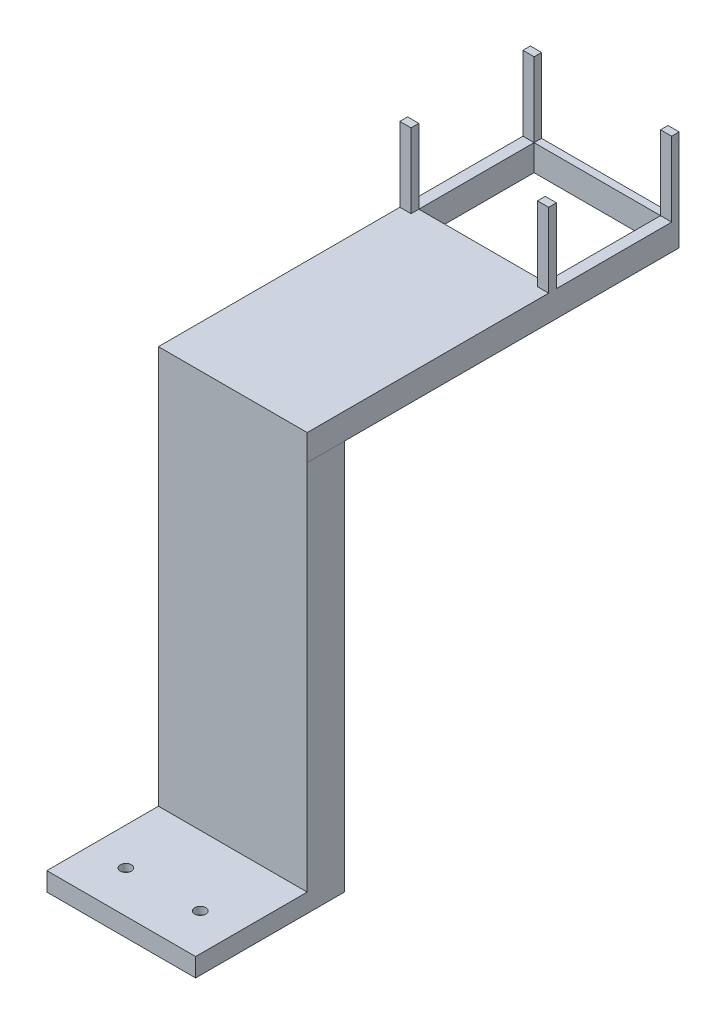
ISO-10303-21;
HEADER;
FILE_DESCRIPTION(('STEP AP214'),'2;1');
FILE_NAME('part.step','',(''),(''),'','','');
FILE_SCHEMA(('AUTOMOTIVE_DESIGN { 1 0 10303 214 1 1 1 1 }'));
ENDSEC;
DATA;
#1=APPLICATION_CONTEXT('core data for automotive mechanical design processes');
#2=APPLICATION_PROTOCOL_DEFINITION('international standard','automotive_design',2000,#1);
#3=PRODUCT_CONTEXT('',#1,'mechanical');
#4=PRODUCT('Part','Part','',(#3));
#5=PRODUCT_RELATED_PRODUCT_CATEGORY('part','',(#4));
#6=PRODUCT_DEFINITION_FORMATION('','',#4);
#7=PRODUCT_DEFINITION_CONTEXT('part definition',#1,'design');
#8=PRODUCT_DEFINITION('design','',#6,#7);
#9=PRODUCT_DEFINITION_SHAPE('','',#8);
#10=(LENGTH_UNIT() NAMED_UNIT(*) SI_UNIT(.MILLI.,.METRE.));
#11=(NAMED_UNIT(*) PLANE_ANGLE_UNIT() SI_UNIT($,.RADIAN.));
#12=(NAMED_UNIT(*) SI_UNIT($,.STERADIAN.) SOLID_ANGLE_UNIT());
#13=UNCERTAINTY_MEASURE_WITH_UNIT(LENGTH_MEASURE(1.E-05),#10,'distance_accuracy_value','');
#14=(GEOMETRIC_REPRESENTATION_CONTEXT(3) GLOBAL_UNCERTAINTY_ASSIGNED_CONTEXT((#13)) GLOBAL_UNIT_ASSIGNED_CONTEXT((#10,
#11,#12)) REPRESENTATION_CONTEXT('',''));
#15=CARTESIAN_POINT('',(0.,0.,0.));
#16=DIRECTION('',(0.,0.,1.));
#17=DIRECTION('',(1.,0.,0.));
#18=AXIS2_PLACEMENT_3D('',#15,#16,#17);
#19=CARTESIAN_POINT('',(0.,112.,0.));
#20=DIRECTION('',(0.,-1.,0.));
#21=DIRECTION('',(0.,0.,-1.));
#22=AXIS2_PLACEMENT_3D('',#19,#20,#21);
#23=PLANE('',#22);
#24=DIRECTION('',(1.,0.,0.));
#25=VECTOR('',#24,1.);
#26=CARTESIAN_POINT('',(37.0017229121583,112.,-94.9067704623263));
#27=LINE('',#26,#25);
#28=CARTESIAN_POINT('',(37.0017229121583,112.,-94.9067704623263));
#29=VERTEX_POINT('',#28);
#30=CARTESIAN_POINT('',(40.0034458243166,112.,-94.9067704623263));
#31=VERTEX_POINT('',#30);
#32=EDGE_CURVE('E59',#29,#31,#27,.T.);
#33=ORIENTED_EDGE('',*,*,#32,.F.);
#34=DIRECTION('',(0.,0.,1.));
#35=VECTOR('',#34,1.);
#36=CARTESIAN_POINT('',(37.0017229121583,112.,-97.));
#37=LINE('',#36,#35);
#38=CARTESIAN_POINT('',(37.0017229121583,112.,-97.));
#39=VERTEX_POINT('',#38);
#40=EDGE_CURVE('E251',#39,#29,#37,.T.);
#41=ORIENTED_EDGE('',*,*,#40,.F.);
#42=DIRECTION('',(1.,0.,0.));
#43=VECTOR('',#42,1.);
#44=CARTESIAN_POINT('',(3.00172291215829,112.,-97.));
#45=LINE('',#44,#43);
#46=CARTESIAN_POINT('',(3.00172291215829,112.,-97.));
#47=VERTEX_POINT('',#46);
#48=EDGE_CURVE('E376',#47,#39,#45,.T.);
#49=ORIENTED_EDGE('',*,*,#48,.F.);
#50=DIRECTION('',(0.,0.,-1.));
#51=VECTOR('',#50,1.);
#52=CARTESIAN_POINT('',(3.00172291215829,112.,-97.));
#53=LINE('',#52,#51);
#54=CARTESIAN_POINT('',(3.00172291215829,112.,-94.9067704623263));
#55=VERTEX_POINT('',#54);
#56=EDGE_CURVE('E292',#55,#47,#53,.T.);
#57=ORIENTED_EDGE('',*,*,#56,.F.);
#58=DIRECTION('',(1.,0.,0.));
#59=VECTOR('',#58,1.);
#60=CARTESIAN_POINT('',(3.00172291215829,112.,-94.9067704623263));
#61=LINE('',#60,#59);
#62=CARTESIAN_POINT('',(0.,112.,-94.9067704623263));
#63=VERTEX_POINT('',#62);
#64=EDGE_CURVE('E283',#63,#55,#61,.T.);
#65=ORIENTED_EDGE('',*,*,#64,.F.);
#66=DIRECTION('',(0.,0.,1.));
#67=VECTOR('',#66,1.);
#68=CARTESIAN_POINT('',(0.,112.,-30.));
#69=LINE('',#68,#67);
#70=CARTESIAN_POINT('',(0.,112.,-30.));
#71=VERTEX_POINT('',#70);
#72=EDGE_CURVE('E406',#63,#71,#69,.T.);
#73=ORIENTED_EDGE('',*,*,#72,.T.);
#74=DIRECTION('',(1.,0.,0.));
#75=VECTOR('',#74,1.);
#76=CARTESIAN_POINT('',(0.,112.,-30.));
#77=LINE('',#76,#75);
#78=CARTESIAN_POINT('',(40.0034458243166,112.,-30.));
#79=VERTEX_POINT('',#78);
#80=EDGE_CURVE('E221',#71,#79,#77,.T.);
#81=ORIENTED_EDGE('',*,*,#80,.T.);
#82=DIRECTION('',(0.,0.,-1.));
#83=VECTOR('',#82,1.);
#84=CARTESIAN_POINT('',(40.0034458243166,112.,-30.));
#85=LINE('',#84,#83);
#86=EDGE_CURVE('E64',#79,#31,#85,.T.);
#87=ORIENTED_EDGE('',*,*,#86,.T.);
#88=EDGE_LOOP('',(#33,#41,#49,#57,#65,#73,#81,#87));
#89=FACE_BOUND('',#88,.T.);
#90=ADVANCED_FACE('F43',(#89),#23,.F.);
#91=DIRECTION('',(-1.,0.,0.));
#92=VECTOR('',#91,1.);
#93=CARTESIAN_POINT('',(37.0017229121583,112.,-97.));
#94=LINE('',#93,#92);
#95=CARTESIAN_POINT('',(40.0034458243166,112.,-97.));
#96=VERTEX_POINT('',#95);
#97=EDGE_CURVE('E225',#96,#39,#94,.T.);
#98=ORIENTED_EDGE('',*,*,#97,.F.);
#99=CARTESIAN_POINT('',(40.0034458243166,112.,-128.));
#100=VERTEX_POINT('',#99);
#101=EDGE_CURVE('E208',#96,#100,#85,.T.);
#102=ORIENTED_EDGE('',*,*,#101,.T.);
#103=DIRECTION('',(1.,0.,0.));
#104=VECTOR('',#103,1.);
#105=CARTESIAN_POINT('',(37.0017229121583,112.,-128.));
#106=LINE('',#105,#104);
#107=CARTESIAN_POINT('',(37.0017229121583,112.,-128.));
#108=VERTEX_POINT('',#107);
#109=EDGE_CURVE('E347',#108,#100,#106,.T.);
#110=ORIENTED_EDGE('',*,*,#109,.F.);
#111=DIRECTION('',(0.,0.,-1.));
#112=VECTOR('',#111,1.);
#113=CARTESIAN_POINT('',(37.0017229121583,112.,-128.));
#114=LINE('',#113,#112);
#115=EDGE_CURVE('E228',#39,#108,#114,.T.);
#116=ORIENTED_EDGE('',*,*,#115,.F.);
#117=EDGE_LOOP('',(#98,#102,#110,#116));
#118=FACE_BOUND('',#117,.T.);
#119=ADVANCED_FACE('F226',(#118),#23,.F.);
#120=DIRECTION('',(-1.,0.,0.));
#121=VECTOR('',#120,1.);
#122=CARTESIAN_POINT('',(3.00172291215829,112.,-97.));
#123=LINE('',#122,#121);
#124=CARTESIAN_POINT('',(0.,112.,-97.));
#125=VERTEX_POINT('',#124);
#126=EDGE_CURVE('E287',#47,#125,#123,.T.);
#127=ORIENTED_EDGE('',*,*,#126,.F.);
#128=DIRECTION('',(0.,0.,1.));
#129=VECTOR('',#128,1.);
#130=CARTESIAN_POINT('',(3.00172291215829,112.,-128.));
#131=LINE('',#130,#129);
#132=CARTESIAN_POINT('',(3.00172291215829,112.,-128.));
#133=VERTEX_POINT('',#132);
#134=EDGE_CURVE('E372',#133,#47,#131,.T.);
#135=ORIENTED_EDGE('',*,*,#134,.F.);
#136=DIRECTION('',(1.,0.,0.));
#137=VECTOR('',#136,1.);
#138=CARTESIAN_POINT('',(3.00172291215829,112.,-128.));
#139=LINE('',#138,#137);
#140=CARTESIAN_POINT('',(0.,112.,-128.));
#141=VERTEX_POINT('',#140);
#142=EDGE_CURVE('E320',#141,#133,#139,.T.);
#143=ORIENTED_EDGE('',*,*,#142,.F.);
#144=EDGE_CURVE('E403',#141,#125,#69,.T.);
#145=ORIENTED_EDGE('',*,*,#144,.T.);
#146=EDGE_LOOP('',(#127,#135,#143,#145));
#147=FACE_BOUND('',#146,.T.);
#148=ADVANCED_FACE('F540',(#147),#23,.F.);
#149=DIRECTION('',(0.,0.,-1.));
#150=VECTOR('',#149,1.);
#151=CARTESIAN_POINT('',(3.00172291215829,112.,-128.));
#152=LINE('',#151,#150);
#153=CARTESIAN_POINT('',(3.00172291215829,112.,-130.));
#154=VERTEX_POINT('',#153);
#155=EDGE_CURVE('E324',#133,#154,#152,.T.);
#156=ORIENTED_EDGE('',*,*,#155,.F.);
#157=DIRECTION('',(-1.,0.,0.));
#158=VECTOR('',#157,1.);
#159=CARTESIAN_POINT('',(3.00172291215829,112.,-128.));
#160=LINE('',#159,#158);
#161=EDGE_CURVE('E382',#108,#133,#160,.T.);
#162=ORIENTED_EDGE('',*,*,#161,.F.);
#163=DIRECTION('',(0.,0.,1.));
#164=VECTOR('',#163,1.);
#165=CARTESIAN_POINT('',(37.0017229121583,112.,-128.));
#166=LINE('',#165,#164);
#167=CARTESIAN_POINT('',(37.0017229121583,112.,-130.));
#168=VERTEX_POINT('',#167);
#169=EDGE_CURVE('E329',#168,#108,#166,.T.);
#170=ORIENTED_EDGE('',*,*,#169,.F.);
#171=DIRECTION('',(-1.,0.,0.));
#172=VECTOR('',#171,1.);
#173=CARTESIAN_POINT('',(0.,112.,-130.));
#174=LINE('',#173,#172);
#175=EDGE_CURVE('E410',#168,#154,#174,.T.);
#176=ORIENTED_EDGE('',*,*,#175,.T.);
#177=EDGE_LOOP('',(#156,#162,#170,#176));
#178=FACE_BOUND('',#177,.T.);
#179=ADVANCED_FACE('F597',(#178),#23,.F.);
#180=CARTESIAN_POINT('',(0.,5.,0.));
#181=DIRECTION('',(0.,-1.,0.));
#182=DIRECTION('',(0.,0.,-1.));
#183=AXIS2_PLACEMENT_3D('',#180,#181,#182);
#184=PLANE('',#183);
#185=CARTESIAN_POINT('',(30.,5.,-11.2517260652819));
#186=DIRECTION('',(0.,1.,0.));
#187=DIRECTION('',(0.,0.,1.));
#188=AXIS2_PLACEMENT_3D('',#185,#186,#187);
#189=CIRCLE('',#188,1.5);
#190=CARTESIAN_POINT('',(30.,5.,-9.75172606528194));
#191=VERTEX_POINT('',#190);
#192=EDGE_CURVE('E457',#191,#191,#189,.T.);
#193=ORIENTED_EDGE('',*,*,#192,.F.);
#194=EDGE_LOOP('',(#193));
#195=FACE_BOUND('',#194,.T.);
#196=CARTESIAN_POINT('',(10.,5.,-11.2517260652819));
#197=DIRECTION('',(0.,1.,0.));
#198=DIRECTION('',(0.,0.,1.));
#199=AXIS2_PLACEMENT_3D('',#196,#197,#198);
#200=CIRCLE('',#199,1.5);
#201=CARTESIAN_POINT('',(10.,5.,-9.75172606528194));
#202=VERTEX_POINT('',#201);
#203=EDGE_CURVE('E463',#202,#202,#200,.T.);
#204=ORIENTED_EDGE('',*,*,#203,.F.);
#205=EDGE_LOOP('',(#204));
#206=FACE_BOUND('',#205,.T.);
#207=DIRECTION('',(1.,0.,0.));
#208=VECTOR('',#207,1.);
#209=CARTESIAN_POINT('',(0.,5.,-30.));
#210=LINE('',#209,#208);
#211=CARTESIAN_POINT('',(0.,5.,-30.));
#212=VERTEX_POINT('',#211);
#213=CARTESIAN_POINT('',(40.,5.,-30.));
#214=VERTEX_POINT('',#213);
#215=EDGE_CURVE('E437',#212,#214,#210,.T.);
#216=ORIENTED_EDGE('',*,*,#215,.F.);
#217=DIRECTION('',(0.,0.,1.));
#218=VECTOR('',#217,1.);
#219=CARTESIAN_POINT('',(0.,5.,0.));
#220=LINE('',#219,#218);
#221=CARTESIAN_POINT('',(0.,5.,0.));
#222=VERTEX_POINT('',#221);
#223=EDGE_CURVE('E474',#212,#222,#220,.T.);
#224=ORIENTED_EDGE('',*,*,#223,.T.);
#225=DIRECTION('',(1.,0.,0.));
#226=VECTOR('',#225,1.);
#227=CARTESIAN_POINT('',(0.,5.,0.));
#228=LINE('',#227,#226);
#229=CARTESIAN_POINT('',(40.,5.,0.));
#230=VERTEX_POINT('',#229);
#231=EDGE_CURVE('E477',#222,#230,#228,.T.);
#232=ORIENTED_EDGE('',*,*,#231,.T.);
#233=DIRECTION('',(0.,0.,-1.));
#234=VECTOR('',#233,1.);
#235=CARTESIAN_POINT('',(40.,5.,0.));
#236=LINE('',#235,#234);
#237=EDGE_CURVE('E481',#230,#214,#236,.T.);
#238=ORIENTED_EDGE('',*,*,#237,.T.);
#239=EDGE_LOOP('',(#216,#224,#232,#238));
#240=FACE_BOUND('',#239,.T.);
#241=ADVANCED_FACE('F604',(#195,#206,#240),#184,.F.);
#242=CARTESIAN_POINT('',(0.,5.,0.));
#243=DIRECTION('',(1.,0.,0.));
#244=DIRECTION('',(0.,0.,-1.));
#245=AXIS2_PLACEMENT_3D('',#242,#243,#244);
#246=PLANE('',#245);
#247=DIRECTION('',(0.,0.,1.));
#248=VECTOR('',#247,1.);
#249=CARTESIAN_POINT('',(0.,0.,0.));
#250=LINE('',#249,#248);
#251=CARTESIAN_POINT('',(0.,0.,-40.));
#252=VERTEX_POINT('',#251);
#253=CARTESIAN_POINT('',(0.,0.,0.));
#254=VERTEX_POINT('',#253);
#255=EDGE_CURVE('E462',#252,#254,#250,.T.);
#256=ORIENTED_EDGE('',*,*,#255,.T.);
#257=DIRECTION('',(0.,-1.,0.));
#258=VECTOR('',#257,1.);
#259=CARTESIAN_POINT('',(0.,5.,0.));
#260=LINE('',#259,#258);
#261=EDGE_CURVE('E507',#222,#254,#260,.T.);
#262=ORIENTED_EDGE('',*,*,#261,.F.);
#263=ORIENTED_EDGE('',*,*,#223,.F.);
#264=DIRECTION('',(0.,-1.,0.));
#265=VECTOR('',#264,1.);
#266=CARTESIAN_POINT('',(0.,105.,-30.));
#267=LINE('',#266,#265);
#268=EDGE_CURVE('E453',#71,#212,#267,.T.);
#269=ORIENTED_EDGE('',*,*,#268,.F.);
#270=ORIENTED_EDGE('',*,*,#72,.F.);
#271=DIRECTION('',(0.,-1.,0.));
#272=VECTOR('',#271,1.);
#273=CARTESIAN_POINT('',(0.,132.,-94.9067704623263));
#274=LINE('',#273,#272);
#275=CARTESIAN_POINT('',(0.,132.,-94.9067704623263));
#276=VERTEX_POINT('',#275);
#277=EDGE_CURVE('E274',#276,#63,#274,.T.);
#278=ORIENTED_EDGE('',*,*,#277,.F.);
#279=DIRECTION('',(0.,0.,1.));
#280=VECTOR('',#279,1.);
#281=CARTESIAN_POINT('',(0.,132.,-97.));
#282=LINE('',#281,#280);
#283=CARTESIAN_POINT('',(0.,132.,-97.));
#284=VERTEX_POINT('',#283);
#285=EDGE_CURVE('E299',#284,#276,#282,.T.);
#286=ORIENTED_EDGE('',*,*,#285,.F.);
#287=DIRECTION('',(0.,-1.,0.));
#288=VECTOR('',#287,1.);
#289=CARTESIAN_POINT('',(0.,132.,-97.));
#290=LINE('',#289,#288);
#291=EDGE_CURVE('E270',#284,#125,#290,.T.);
#292=ORIENTED_EDGE('',*,*,#291,.T.);
#293=ORIENTED_EDGE('',*,*,#144,.F.);
#294=DIRECTION('',(0.,-1.,0.));
#295=VECTOR('',#294,1.);
#296=CARTESIAN_POINT('',(0.,132.,-128.));
#297=LINE('',#296,#295);
#298=CARTESIAN_POINT('',(0.,132.,-128.));
#299=VERTEX_POINT('',#298);
#300=EDGE_CURVE('E311',#299,#141,#297,.T.);
#301=ORIENTED_EDGE('',*,*,#300,.F.);
#302=DIRECTION('',(0.,0.,1.));
#303=VECTOR('',#302,1.);
#304=CARTESIAN_POINT('',(0.,132.,-128.));
#305=LINE('',#304,#303);
#306=CARTESIAN_POINT('',(0.,132.,-130.));
#307=VERTEX_POINT('',#306);
#308=EDGE_CURVE('E332',#307,#299,#305,.T.);
#309=ORIENTED_EDGE('',*,*,#308,.F.);
#310=DIRECTION('',(0.,-1.,0.));
#311=VECTOR('',#310,1.);
#312=CARTESIAN_POINT('',(0.,112.,-130.));
#313=LINE('',#312,#311);
#314=CARTESIAN_POINT('',(0.,105.,-130.));
#315=VERTEX_POINT('',#314);
#316=EDGE_CURVE('E413',#307,#315,#313,.T.);
#317=ORIENTED_EDGE('',*,*,#316,.T.);
#318=DIRECTION('',(0.,0.,1.));
#319=VECTOR('',#318,1.);
#320=CARTESIAN_POINT('',(0.,105.,-30.));
#321=LINE('',#320,#319);
#322=CARTESIAN_POINT('',(0.,105.,-40.));
#323=VERTEX_POINT('',#322);
#324=EDGE_CURVE('E391',#315,#323,#321,.T.);
#325=ORIENTED_EDGE('',*,*,#324,.T.);
#326=DIRECTION('',(0.,-1.,0.));
#327=VECTOR('',#326,1.);
#328=CARTESIAN_POINT('',(0.,5.,-40.));
#329=LINE('',#328,#327);
#330=EDGE_CURVE('E484',#323,#252,#329,.T.);
#331=ORIENTED_EDGE('',*,*,#330,.T.);
#332=EDGE_LOOP('',(#256,#262,#263,#269,#270,#278,#286,#292,#293,#301,#309,#317,#325,#331));
#333=FACE_BOUND('',#332,.T.);
#334=ADVANCED_FACE('F45',(#333),#246,.F.);
#335=CARTESIAN_POINT('',(0.,5.,0.));
#336=DIRECTION('',(0.,0.,-1.));
#337=DIRECTION('',(-1.,0.,0.));
#338=AXIS2_PLACEMENT_3D('',#335,#336,#337);
#339=PLANE('',#338);
#340=DIRECTION('',(1.,0.,0.));
#341=VECTOR('',#340,1.);
#342=CARTESIAN_POINT('',(0.,0.,0.));
#343=LINE('',#342,#341);
#344=CARTESIAN_POINT('',(40.,0.,0.));
#345=VERTEX_POINT('',#344);
#346=EDGE_CURVE('E488',#254,#345,#343,.T.);
#347=ORIENTED_EDGE('',*,*,#346,.T.);
#348=DIRECTION('',(0.,-1.,0.));
#349=VECTOR('',#348,1.);
#350=CARTESIAN_POINT('',(40.,5.,0.));
#351=LINE('',#350,#349);
#352=EDGE_CURVE('E503',#230,#345,#351,.T.);
#353=ORIENTED_EDGE('',*,*,#352,.F.);
#354=ORIENTED_EDGE('',*,*,#231,.F.);
#355=ORIENTED_EDGE('',*,*,#261,.T.);
#356=EDGE_LOOP('',(#347,#353,#354,#355));
#357=FACE_BOUND('',#356,.T.);
#358=ADVANCED_FACE('F631',(#357),#339,.F.);
#359=CARTESIAN_POINT('',(40.,5.,0.));
#360=DIRECTION('',(-1.,0.,0.));
#361=DIRECTION('',(0.,0.,1.));
#362=AXIS2_PLACEMENT_3D('',#359,#360,#361);
#363=PLANE('',#362);
#364=DIRECTION('',(0.,0.,-1.));
#365=VECTOR('',#364,1.);
#366=CARTESIAN_POINT('',(40.,0.,0.));
#367=LINE('',#366,#365);
#368=CARTESIAN_POINT('',(40.,0.,-40.));
#369=VERTEX_POINT('',#368);
#370=EDGE_CURVE('E491',#345,#369,#367,.T.);
#371=ORIENTED_EDGE('',*,*,#370,.T.);
#372=DIRECTION('',(0.,-1.,0.));
#373=VECTOR('',#372,1.);
#374=CARTESIAN_POINT('',(40.,5.,-40.));
#375=LINE('',#374,#373);
#376=CARTESIAN_POINT('',(40.,105.,-40.));
#377=VERTEX_POINT('',#376);
#378=EDGE_CURVE('E499',#377,#369,#375,.T.);
#379=ORIENTED_EDGE('',*,*,#378,.F.);
#380=DIRECTION('',(0.,0.,-1.));
#381=VECTOR('',#380,1.);
#382=CARTESIAN_POINT('',(40.,105.,-40.));
#383=LINE('',#382,#381);
#384=CARTESIAN_POINT('',(40.,105.,-30.));
#385=VERTEX_POINT('',#384);
#386=EDGE_CURVE('E438',#385,#377,#383,.T.);
#387=ORIENTED_EDGE('',*,*,#386,.F.);
#388=DIRECTION('',(0.,-1.,0.));
#389=VECTOR('',#388,1.);
#390=CARTESIAN_POINT('',(40.,105.,-30.));
#391=LINE('',#390,#389);
#392=EDGE_CURVE('E446',#385,#214,#391,.T.);
#393=ORIENTED_EDGE('',*,*,#392,.T.);
#394=ORIENTED_EDGE('',*,*,#237,.F.);
#395=ORIENTED_EDGE('',*,*,#352,.T.);
#396=EDGE_LOOP('',(#371,#379,#387,#393,#394,#395));
#397=FACE_BOUND('',#396,.T.);
#398=ADVANCED_FACE('F635',(#397),#363,.F.);
#399=CARTESIAN_POINT('',(0.,5.,-40.));
#400=DIRECTION('',(0.,0.,1.));
#401=DIRECTION('',(1.,0.,0.));
#402=AXIS2_PLACEMENT_3D('',#399,#400,#401);
#403=PLANE('',#402);
#404=DIRECTION('',(-1.,0.,0.));
#405=VECTOR('',#404,1.);
#406=CARTESIAN_POINT('',(0.,0.,-40.));
#407=LINE('',#406,#405);
#408=EDGE_CURVE('E478',#369,#252,#407,.T.);
#409=ORIENTED_EDGE('',*,*,#408,.T.);
#410=ORIENTED_EDGE('',*,*,#330,.F.);
#411=DIRECTION('',(-1.,0.,0.));
#412=VECTOR('',#411,1.);
#413=CARTESIAN_POINT('',(0.,105.,-40.));
#414=LINE('',#413,#412);
#415=EDGE_CURVE('E442',#377,#323,#414,.T.);
#416=ORIENTED_EDGE('',*,*,#415,.F.);
#417=ORIENTED_EDGE('',*,*,#378,.T.);
#418=EDGE_LOOP('',(#409,#410,#416,#417));
#419=FACE_BOUND('',#418,.T.);
#420=ADVANCED_FACE('F621',(#419),#403,.F.);
#421=CARTESIAN_POINT('',(0.,0.,0.));
#422=DIRECTION('',(0.,-1.,0.));
#423=DIRECTION('',(0.,0.,-1.));
#424=AXIS2_PLACEMENT_3D('',#421,#422,#423);
#425=PLANE('',#424);
#426=ORIENTED_EDGE('',*,*,#255,.F.);
#427=ORIENTED_EDGE('',*,*,#408,.F.);
#428=ORIENTED_EDGE('',*,*,#370,.F.);
#429=ORIENTED_EDGE('',*,*,#346,.F.);
#430=EDGE_LOOP('',(#426,#427,#428,#429));
#431=FACE_BOUND('',#430,.T.);
#432=ADVANCED_FACE('F626',(#431),#425,.T.);
#433=CARTESIAN_POINT('',(30.,3.,-11.2517260652819));
#434=DIRECTION('',(0.,1.,0.));
#435=DIRECTION('',(0.,0.,1.));
#436=AXIS2_PLACEMENT_3D('',#433,#434,#435);
#437=CYLINDRICAL_SURFACE('',#436,1.5);
#438=CARTESIAN_POINT('',(30.,3.,-11.2517260652819));
#439=DIRECTION('',(0.,1.,0.));
#440=DIRECTION('',(0.,0.,1.));
#441=AXIS2_PLACEMENT_3D('',#438,#439,#440);
#442=CIRCLE('',#441,1.5);
#443=CARTESIAN_POINT('',(30.,3.,-9.75172606528194));
#444=VERTEX_POINT('',#443);
#445=EDGE_CURVE('E467',#444,#444,#442,.T.);
#446=ORIENTED_EDGE('',*,*,#445,.F.);
#447=EDGE_LOOP('',(#446));
#448=FACE_BOUND('',#447,.T.);
#449=ORIENTED_EDGE('',*,*,#192,.T.);
#450=EDGE_LOOP('',(#449));
#451=FACE_BOUND('',#450,.T.);
#452=ADVANCED_FACE('F682',(#448,#451),#437,.F.);
#453=CARTESIAN_POINT('',(0.,3.,0.));
#454=DIRECTION('',(0.,1.,0.));
#455=DIRECTION('',(0.,0.,1.));
#456=AXIS2_PLACEMENT_3D('',#453,#454,#455);
#457=PLANE('',#456);
#458=ORIENTED_EDGE('',*,*,#445,.T.);
#459=EDGE_LOOP('',(#458));
#460=FACE_BOUND('',#459,.T.);
#461=ADVANCED_FACE('F678',(#460),#457,.T.);
#462=CARTESIAN_POINT('',(10.,3.,-11.2517260652819));
#463=DIRECTION('',(0.,1.,0.));
#464=DIRECTION('',(0.,0.,1.));
#465=AXIS2_PLACEMENT_3D('',#462,#463,#464);
#466=CYLINDRICAL_SURFACE('',#465,1.5);
#467=CARTESIAN_POINT('',(10.,3.,-11.2517260652819));
#468=DIRECTION('',(0.,1.,0.));
#469=DIRECTION('',(0.,0.,1.));
#470=AXIS2_PLACEMENT_3D('',#467,#468,#469);
#471=CIRCLE('',#470,1.5);
#472=CARTESIAN_POINT('',(10.,3.,-9.75172606528194));
#473=VERTEX_POINT('',#472);
#474=EDGE_CURVE('E458',#473,#473,#471,.T.);
#475=ORIENTED_EDGE('',*,*,#474,.F.);
#476=EDGE_LOOP('',(#475));
#477=FACE_BOUND('',#476,.T.);
#478=ORIENTED_EDGE('',*,*,#203,.T.);
#479=EDGE_LOOP('',(#478));
#480=FACE_BOUND('',#479,.T.);
#481=ADVANCED_FACE('F674',(#477,#480),#466,.F.);
#482=CARTESIAN_POINT('',(0.,3.,0.));
#483=DIRECTION('',(0.,1.,0.));
#484=DIRECTION('',(0.,0.,1.));
#485=AXIS2_PLACEMENT_3D('',#482,#483,#484);
#486=PLANE('',#485);
#487=ORIENTED_EDGE('',*,*,#474,.T.);
#488=EDGE_LOOP('',(#487));
#489=FACE_BOUND('',#488,.T.);
#490=ADVANCED_FACE('F671',(#489),#486,.T.);
#491=CARTESIAN_POINT('',(0.,105.,-30.));
#492=DIRECTION('',(0.,0.,-1.));
#493=DIRECTION('',(-1.,0.,0.));
#494=AXIS2_PLACEMENT_3D('',#491,#492,#493);
#495=PLANE('',#494);
#496=ORIENTED_EDGE('',*,*,#215,.T.);
#497=ORIENTED_EDGE('',*,*,#392,.F.);
#498=DIRECTION('',(1.,0.,0.));
#499=VECTOR('',#498,1.);
#500=CARTESIAN_POINT('',(0.,105.,-30.));
#501=LINE('',#500,#499);
#502=CARTESIAN_POINT('',(40.0034458243166,105.,-30.));
#503=VERTEX_POINT('',#502);
#504=EDGE_CURVE('E417',#385,#503,#501,.T.);
#505=ORIENTED_EDGE('',*,*,#504,.T.);
#506=DIRECTION('',(0.,-1.,0.));
#507=VECTOR('',#506,1.);
#508=CARTESIAN_POINT('',(40.0034458243166,112.,-30.));
#509=LINE('',#508,#507);
#510=EDGE_CURVE('E433',#79,#503,#509,.T.);
#511=ORIENTED_EDGE('',*,*,#510,.F.);
#512=ORIENTED_EDGE('',*,*,#80,.F.);
#513=ORIENTED_EDGE('',*,*,#268,.T.);
#514=EDGE_LOOP('',(#496,#497,#505,#511,#512,#513));
#515=FACE_BOUND('',#514,.T.);
#516=ADVANCED_FACE('F575',(#515),#495,.F.);
#517=CARTESIAN_POINT('',(40.0034458243166,112.,-30.));
#518=DIRECTION('',(-1.,0.,0.));
#519=DIRECTION('',(0.,0.,1.));
#520=AXIS2_PLACEMENT_3D('',#517,#518,#519);
#521=PLANE('',#520);
#522=DIRECTION('',(0.,0.,-1.));
#523=VECTOR('',#522,1.);
#524=CARTESIAN_POINT('',(40.0034458243166,105.,-30.));
#525=LINE('',#524,#523);
#526=CARTESIAN_POINT('',(40.0034458243166,105.,-130.));
#527=VERTEX_POINT('',#526);
#528=EDGE_CURVE('E420',#503,#527,#525,.T.);
#529=ORIENTED_EDGE('',*,*,#528,.T.);
#530=DIRECTION('',(0.,-1.,0.));
#531=VECTOR('',#530,1.);
#532=CARTESIAN_POINT('',(40.0034458243166,112.,-130.));
#533=LINE('',#532,#531);
#534=CARTESIAN_POINT('',(40.0034458243166,132.,-130.));
#535=VERTEX_POINT('',#534);
#536=EDGE_CURVE('E429',#535,#527,#533,.T.);
#537=ORIENTED_EDGE('',*,*,#536,.F.);
#538=DIRECTION('',(0.,0.,-1.));
#539=VECTOR('',#538,1.);
#540=CARTESIAN_POINT('',(40.0034458243166,132.,-128.));
#541=LINE('',#540,#539);
#542=CARTESIAN_POINT('',(40.0034458243166,132.,-128.));
#543=VERTEX_POINT('',#542);
#544=EDGE_CURVE('E350',#543,#535,#541,.T.);
#545=ORIENTED_EDGE('',*,*,#544,.F.);
#546=DIRECTION('',(0.,-1.,0.));
#547=VECTOR('',#546,1.);
#548=CARTESIAN_POINT('',(40.0034458243166,132.,-128.));
#549=LINE('',#548,#547);
#550=EDGE_CURVE('E217',#543,#100,#549,.T.);
#551=ORIENTED_EDGE('',*,*,#550,.T.);
#552=ORIENTED_EDGE('',*,*,#101,.F.);
#553=DIRECTION('',(0.,-1.,0.));
#554=VECTOR('',#553,1.);
#555=CARTESIAN_POINT('',(40.0034458243166,132.,-97.));
#556=LINE('',#555,#554);
#557=CARTESIAN_POINT('',(40.0034458243166,132.,-97.));
#558=VERTEX_POINT('',#557);
#559=EDGE_CURVE('E213',#558,#96,#556,.T.);
#560=ORIENTED_EDGE('',*,*,#559,.F.);
#561=DIRECTION('',(0.,0.,-1.));
#562=VECTOR('',#561,1.);
#563=CARTESIAN_POINT('',(40.0034458243166,132.,-97.));
#564=LINE('',#563,#562);
#565=CARTESIAN_POINT('',(40.0034458243166,132.,-94.9067704623263));
#566=VERTEX_POINT('',#565);
#567=EDGE_CURVE('E258',#566,#558,#564,.T.);
#568=ORIENTED_EDGE('',*,*,#567,.F.);
#569=DIRECTION('',(0.,-1.,0.));
#570=VECTOR('',#569,1.);
#571=CARTESIAN_POINT('',(40.0034458243166,132.,-94.9067704623263));
#572=LINE('',#571,#570);
#573=EDGE_CURVE('E239',#566,#31,#572,.T.);
#574=ORIENTED_EDGE('',*,*,#573,.T.);
#575=ORIENTED_EDGE('',*,*,#86,.F.);
#576=ORIENTED_EDGE('',*,*,#510,.T.);
#577=EDGE_LOOP('',(#529,#537,#545,#551,#552,#560,#568,#574,#575,#576));
#578=FACE_BOUND('',#577,.T.);
#579=ADVANCED_FACE('F210',(#578),#521,.F.);
#580=CARTESIAN_POINT('',(0.,112.,-130.));
#581=DIRECTION('',(0.,0.,1.));
#582=DIRECTION('',(1.,0.,0.));
#583=AXIS2_PLACEMENT_3D('',#580,#581,#582);
#584=PLANE('',#583);
#585=DIRECTION('',(-1.,0.,0.));
#586=VECTOR('',#585,1.);
#587=CARTESIAN_POINT('',(0.,105.,-130.));
#588=LINE('',#587,#586);
#589=EDGE_CURVE('E423',#527,#315,#588,.T.);
#590=ORIENTED_EDGE('',*,*,#589,.T.);
#591=ORIENTED_EDGE('',*,*,#316,.F.);
#592=DIRECTION('',(-1.,0.,0.));
#593=VECTOR('',#592,1.);
#594=CARTESIAN_POINT('',(3.00172291215829,132.,-130.));
#595=LINE('',#594,#593);
#596=CARTESIAN_POINT('',(3.00172291215829,132.,-130.));
#597=VERTEX_POINT('',#596);
#598=EDGE_CURVE('E335',#597,#307,#595,.T.);
#599=ORIENTED_EDGE('',*,*,#598,.F.);
#600=DIRECTION('',(0.,-1.,0.));
#601=VECTOR('',#600,1.);
#602=CARTESIAN_POINT('',(3.00172291215829,132.,-130.));
#603=LINE('',#602,#601);
#604=EDGE_CURVE('E296',#597,#154,#603,.T.);
#605=ORIENTED_EDGE('',*,*,#604,.T.);
#606=ORIENTED_EDGE('',*,*,#175,.F.);
#607=DIRECTION('',(0.,-1.,0.));
#608=VECTOR('',#607,1.);
#609=CARTESIAN_POINT('',(37.0017229121583,132.,-130.));
#610=LINE('',#609,#608);
#611=CARTESIAN_POINT('',(37.0017229121583,132.,-130.));
#612=VERTEX_POINT('',#611);
#613=EDGE_CURVE('E357',#612,#168,#610,.T.);
#614=ORIENTED_EDGE('',*,*,#613,.F.);
#615=DIRECTION('',(-1.,0.,0.));
#616=VECTOR('',#615,1.);
#617=CARTESIAN_POINT('',(37.0017229121583,132.,-130.));
#618=LINE('',#617,#616);
#619=EDGE_CURVE('E354',#535,#612,#618,.T.);
#620=ORIENTED_EDGE('',*,*,#619,.F.);
#621=ORIENTED_EDGE('',*,*,#536,.T.);
#622=EDGE_LOOP('',(#590,#591,#599,#605,#606,#614,#620,#621));
#623=FACE_BOUND('',#622,.T.);
#624=ADVANCED_FACE('F615',(#623),#584,.F.);
#625=CARTESIAN_POINT('',(0.,105.,0.));
#626=DIRECTION('',(0.,-1.,0.));
#627=DIRECTION('',(0.,0.,-1.));
#628=AXIS2_PLACEMENT_3D('',#625,#626,#627);
#629=PLANE('',#628);
#630=DIRECTION('',(0.,0.,-1.));
#631=VECTOR('',#630,1.);
#632=CARTESIAN_POINT('',(3.00172291215829,105.,0.));
#633=LINE('',#632,#631);
#634=CARTESIAN_POINT('',(3.00172291215829,105.,-97.));
#635=VERTEX_POINT('',#634);
#636=CARTESIAN_POINT('',(3.00172291215829,105.,-128.));
#637=VERTEX_POINT('',#636);
#638=EDGE_CURVE('E11',#635,#637,#633,.T.);
#639=ORIENTED_EDGE('',*,*,#638,.F.);
#640=DIRECTION('',(-1.,0.,0.));
#641=VECTOR('',#640,1.);
#642=CARTESIAN_POINT('',(0.,105.,-97.));
#643=LINE('',#642,#641);
#644=CARTESIAN_POINT('',(37.0017229121583,105.,-97.));
#645=VERTEX_POINT('',#644);
#646=EDGE_CURVE('E511',#645,#635,#643,.T.);
#647=ORIENTED_EDGE('',*,*,#646,.F.);
#648=DIRECTION('',(0.,0.,1.));
#649=VECTOR('',#648,1.);
#650=CARTESIAN_POINT('',(37.0017229121583,105.,0.));
#651=LINE('',#650,#649);
#652=CARTESIAN_POINT('',(37.0017229121583,105.,-128.));
#653=VERTEX_POINT('',#652);
#654=EDGE_CURVE('E514',#653,#645,#651,.T.);
#655=ORIENTED_EDGE('',*,*,#654,.F.);
#656=DIRECTION('',(1.,0.,0.));
#657=VECTOR('',#656,1.);
#658=CARTESIAN_POINT('',(0.,105.,-128.));
#659=LINE('',#658,#657);
#660=EDGE_CURVE('E52',#637,#653,#659,.T.);
#661=ORIENTED_EDGE('',*,*,#660,.F.);
#662=EDGE_LOOP('',(#639,#647,#655,#661));
#663=FACE_BOUND('',#662,.T.);
#664=ORIENTED_EDGE('',*,*,#504,.F.);
#665=ORIENTED_EDGE('',*,*,#386,.T.);
#666=ORIENTED_EDGE('',*,*,#415,.T.);
#667=ORIENTED_EDGE('',*,*,#324,.F.);
#668=ORIENTED_EDGE('',*,*,#589,.F.);
#669=ORIENTED_EDGE('',*,*,#528,.F.);
#670=EDGE_LOOP('',(#664,#665,#666,#667,#668,#669));
#671=FACE_BOUND('',#670,.T.);
#672=ADVANCED_FACE('F530',(#663,#671),#629,.T.);
#673=CARTESIAN_POINT('',(3.00172291215829,12.,-128.));
#674=DIRECTION('',(-1.,0.,0.));
#675=DIRECTION('',(0.,0.,1.));
#676=AXIS2_PLACEMENT_3D('',#673,#674,#675);
#677=PLANE('',#676);
#678=ORIENTED_EDGE('',*,*,#638,.T.);
#679=DIRECTION('',(0.,1.,0.));
#680=VECTOR('',#679,1.);
#681=CARTESIAN_POINT('',(3.00172291215829,12.,-128.));
#682=LINE('',#681,#680);
#683=EDGE_CURVE('E387',#637,#133,#682,.T.);
#684=ORIENTED_EDGE('',*,*,#683,.T.);
#685=ORIENTED_EDGE('',*,*,#134,.T.);
#686=DIRECTION('',(0.,1.,0.));
#687=VECTOR('',#686,1.);
#688=CARTESIAN_POINT('',(3.00172291215829,12.,-97.));
#689=LINE('',#688,#687);
#690=EDGE_CURVE('E386',#635,#47,#689,.T.);
#691=ORIENTED_EDGE('',*,*,#690,.F.);
#692=EDGE_LOOP('',(#678,#684,#685,#691));
#693=FACE_BOUND('',#692,.T.);
#694=ADVANCED_FACE('F537',(#693),#677,.F.);
#695=CARTESIAN_POINT('',(3.00172291215829,12.,-128.));
#696=DIRECTION('',(0.,0.,-1.));
#697=DIRECTION('',(-1.,0.,0.));
#698=AXIS2_PLACEMENT_3D('',#695,#696,#697);
#699=PLANE('',#698);
#700=ORIENTED_EDGE('',*,*,#660,.T.);
#701=DIRECTION('',(0.,1.,0.));
#702=VECTOR('',#701,1.);
#703=CARTESIAN_POINT('',(37.0017229121583,12.,-128.));
#704=LINE('',#703,#702);
#705=EDGE_CURVE('E392',#653,#108,#704,.T.);
#706=ORIENTED_EDGE('',*,*,#705,.T.);
#707=ORIENTED_EDGE('',*,*,#161,.T.);
#708=ORIENTED_EDGE('',*,*,#683,.F.);
#709=EDGE_LOOP('',(#700,#706,#707,#708));
#710=FACE_BOUND('',#709,.T.);
#711=ADVANCED_FACE('F522',(#710),#699,.F.);
#712=CARTESIAN_POINT('',(37.0017229121583,12.,-128.));
#713=DIRECTION('',(1.,0.,0.));
#714=DIRECTION('',(0.,0.,-1.));
#715=AXIS2_PLACEMENT_3D('',#712,#713,#714);
#716=PLANE('',#715);
#717=ORIENTED_EDGE('',*,*,#654,.T.);
#718=DIRECTION('',(0.,1.,0.));
#719=VECTOR('',#718,1.);
#720=CARTESIAN_POINT('',(37.0017229121583,12.,-97.));
#721=LINE('',#720,#719);
#722=EDGE_CURVE('E396',#645,#39,#721,.T.);
#723=ORIENTED_EDGE('',*,*,#722,.T.);
#724=ORIENTED_EDGE('',*,*,#115,.T.);
#725=ORIENTED_EDGE('',*,*,#705,.F.);
#726=EDGE_LOOP('',(#717,#723,#724,#725));
#727=FACE_BOUND('',#726,.T.);
#728=ADVANCED_FACE('F527',(#727),#716,.F.);
#729=CARTESIAN_POINT('',(3.00172291215829,12.,-97.));
#730=DIRECTION('',(0.,0.,1.));
#731=DIRECTION('',(1.,0.,0.));
#732=AXIS2_PLACEMENT_3D('',#729,#730,#731);
#733=PLANE('',#732);
#734=ORIENTED_EDGE('',*,*,#646,.T.);
#735=ORIENTED_EDGE('',*,*,#690,.T.);
#736=ORIENTED_EDGE('',*,*,#48,.T.);
#737=ORIENTED_EDGE('',*,*,#722,.F.);
#738=EDGE_LOOP('',(#734,#735,#736,#737));
#739=FACE_BOUND('',#738,.T.);
#740=ADVANCED_FACE('F534',(#739),#733,.F.);
#741=CARTESIAN_POINT('',(37.0017229121583,132.,-128.));
#742=DIRECTION('',(1.,0.,0.));
#743=DIRECTION('',(0.,0.,-1.));
#744=AXIS2_PLACEMENT_3D('',#741,#742,#743);
#745=PLANE('',#744);
#746=ORIENTED_EDGE('',*,*,#169,.T.);
#747=DIRECTION('',(0.,-1.,0.));
#748=VECTOR('',#747,1.);
#749=CARTESIAN_POINT('',(37.0017229121583,132.,-128.));
#750=LINE('',#749,#748);
#751=CARTESIAN_POINT('',(37.0017229121583,132.,-128.));
#752=VERTEX_POINT('',#751);
#753=EDGE_CURVE('E368',#752,#108,#750,.T.);
#754=ORIENTED_EDGE('',*,*,#753,.F.);
#755=DIRECTION('',(0.,0.,1.));
#756=VECTOR('',#755,1.);
#757=CARTESIAN_POINT('',(37.0017229121583,132.,-128.));
#758=LINE('',#757,#756);
#759=EDGE_CURVE('E342',#612,#752,#758,.T.);
#760=ORIENTED_EDGE('',*,*,#759,.F.);
#761=ORIENTED_EDGE('',*,*,#613,.T.);
#762=EDGE_LOOP('',(#746,#754,#760,#761));
#763=FACE_BOUND('',#762,.T.);
#764=ADVANCED_FACE('F644',(#763),#745,.F.);
#765=CARTESIAN_POINT('',(37.0017229121583,132.,-128.));
#766=DIRECTION('',(0.,0.,-1.));
#767=DIRECTION('',(-1.,0.,0.));
#768=AXIS2_PLACEMENT_3D('',#765,#766,#767);
#769=PLANE('',#768);
#770=ORIENTED_EDGE('',*,*,#109,.T.);
#771=ORIENTED_EDGE('',*,*,#550,.F.);
#772=DIRECTION('',(1.,0.,0.));
#773=VECTOR('',#772,1.);
#774=CARTESIAN_POINT('',(37.0017229121583,132.,-128.));
#775=LINE('',#774,#773);
#776=EDGE_CURVE('E346',#752,#543,#775,.T.);
#777=ORIENTED_EDGE('',*,*,#776,.F.);
#778=ORIENTED_EDGE('',*,*,#753,.T.);
#779=EDGE_LOOP('',(#770,#771,#777,#778));
#780=FACE_BOUND('',#779,.T.);
#781=ADVANCED_FACE('F642',(#780),#769,.F.);
#782=CARTESIAN_POINT('',(0.,132.,0.));
#783=DIRECTION('',(0.,-1.,0.));
#784=DIRECTION('',(0.,0.,-1.));
#785=AXIS2_PLACEMENT_3D('',#782,#783,#784);
#786=PLANE('',#785);
#787=ORIENTED_EDGE('',*,*,#759,.T.);
#788=ORIENTED_EDGE('',*,*,#776,.T.);
#789=ORIENTED_EDGE('',*,*,#544,.T.);
#790=ORIENTED_EDGE('',*,*,#619,.T.);
#791=EDGE_LOOP('',(#787,#788,#789,#790));
#792=FACE_BOUND('',#791,.T.);
#793=ADVANCED_FACE('F639',(#792),#786,.F.);
#794=CARTESIAN_POINT('',(3.00172291215829,132.,-128.));
#795=DIRECTION('',(-1.,0.,0.));
#796=DIRECTION('',(0.,0.,1.));
#797=AXIS2_PLACEMENT_3D('',#794,#795,#796);
#798=PLANE('',#797);
#799=ORIENTED_EDGE('',*,*,#155,.T.);
#800=ORIENTED_EDGE('',*,*,#604,.F.);
#801=DIRECTION('',(0.,0.,-1.));
#802=VECTOR('',#801,1.);
#803=CARTESIAN_POINT('',(3.00172291215829,132.,-128.));
#804=LINE('',#803,#802);
#805=CARTESIAN_POINT('',(3.00172291215829,132.,-128.));
#806=VERTEX_POINT('',#805);
#807=EDGE_CURVE('E325',#806,#597,#804,.T.);
#808=ORIENTED_EDGE('',*,*,#807,.F.);
#809=DIRECTION('',(0.,-1.,0.));
#810=VECTOR('',#809,1.);
#811=CARTESIAN_POINT('',(3.00172291215829,132.,-128.));
#812=LINE('',#811,#810);
#813=EDGE_CURVE('E315',#806,#133,#812,.T.);
#814=ORIENTED_EDGE('',*,*,#813,.T.);
#815=EDGE_LOOP('',(#799,#800,#808,#814));
#816=FACE_BOUND('',#815,.T.);
#817=ADVANCED_FACE('F549',(#816),#798,.F.);
#818=CARTESIAN_POINT('',(3.00172291215829,132.,-128.));
#819=DIRECTION('',(0.,0.,-1.));
#820=DIRECTION('',(-1.,0.,0.));
#821=AXIS2_PLACEMENT_3D('',#818,#819,#820);
#822=PLANE('',#821);
#823=ORIENTED_EDGE('',*,*,#142,.T.);
#824=ORIENTED_EDGE('',*,*,#813,.F.);
#825=DIRECTION('',(1.,0.,0.));
#826=VECTOR('',#825,1.);
#827=CARTESIAN_POINT('',(3.00172291215829,132.,-128.));
#828=LINE('',#827,#826);
#829=EDGE_CURVE('E319',#299,#806,#828,.T.);
#830=ORIENTED_EDGE('',*,*,#829,.F.);
#831=ORIENTED_EDGE('',*,*,#300,.T.);
#832=EDGE_LOOP('',(#823,#824,#830,#831));
#833=FACE_BOUND('',#832,.T.);
#834=ADVANCED_FACE('F544',(#833),#822,.F.);
#835=CARTESIAN_POINT('',(0.,132.,0.));
#836=DIRECTION('',(0.,1.,0.));
#837=DIRECTION('',(0.,0.,1.));
#838=AXIS2_PLACEMENT_3D('',#835,#836,#837);
#839=PLANE('',#838);
#840=ORIENTED_EDGE('',*,*,#807,.T.);
#841=ORIENTED_EDGE('',*,*,#598,.T.);
#842=ORIENTED_EDGE('',*,*,#308,.T.);
#843=ORIENTED_EDGE('',*,*,#829,.T.);
#844=EDGE_LOOP('',(#840,#841,#842,#843));
#845=FACE_BOUND('',#844,.T.);
#846=ADVANCED_FACE('F552',(#845),#839,.T.);
#847=CARTESIAN_POINT('',(3.00172291215829,132.,-97.));
#848=DIRECTION('',(-1.,0.,0.));
#849=DIRECTION('',(0.,0.,1.));
#850=AXIS2_PLACEMENT_3D('',#847,#848,#849);
#851=PLANE('',#850);
#852=ORIENTED_EDGE('',*,*,#56,.T.);
#853=DIRECTION('',(0.,-1.,0.));
#854=VECTOR('',#853,1.);
#855=CARTESIAN_POINT('',(3.00172291215829,132.,-97.));
#856=LINE('',#855,#854);
#857=CARTESIAN_POINT('',(3.00172291215829,132.,-97.));
#858=VERTEX_POINT('',#857);
#859=EDGE_CURVE('E255',#858,#47,#856,.T.);
#860=ORIENTED_EDGE('',*,*,#859,.F.);
#861=DIRECTION('',(0.,0.,-1.));
#862=VECTOR('',#861,1.);
#863=CARTESIAN_POINT('',(3.00172291215829,132.,-97.));
#864=LINE('',#863,#862);
#865=CARTESIAN_POINT('',(3.00172291215829,132.,-94.9067704623263));
#866=VERTEX_POINT('',#865);
#867=EDGE_CURVE('E288',#866,#858,#864,.T.);
#868=ORIENTED_EDGE('',*,*,#867,.F.);
#869=DIRECTION('',(0.,-1.,0.));
#870=VECTOR('',#869,1.);
#871=CARTESIAN_POINT('',(3.00172291215829,132.,-94.9067704623263));
#872=LINE('',#871,#870);
#873=EDGE_CURVE('E278',#866,#55,#872,.T.);
#874=ORIENTED_EDGE('',*,*,#873,.T.);
#875=EDGE_LOOP('',(#852,#860,#868,#874));
#876=FACE_BOUND('',#875,.T.);
#877=ADVANCED_FACE('F562',(#876),#851,.F.);
#878=CARTESIAN_POINT('',(3.00172291215829,132.,-97.));
#879=DIRECTION('',(0.,0.,1.));
#880=DIRECTION('',(1.,0.,0.));
#881=AXIS2_PLACEMENT_3D('',#878,#879,#880);
#882=PLANE('',#881);
#883=ORIENTED_EDGE('',*,*,#126,.T.);
#884=ORIENTED_EDGE('',*,*,#291,.F.);
#885=DIRECTION('',(-1.,0.,0.));
#886=VECTOR('',#885,1.);
#887=CARTESIAN_POINT('',(3.00172291215829,132.,-97.));
#888=LINE('',#887,#886);
#889=EDGE_CURVE('E302',#858,#284,#888,.T.);
#890=ORIENTED_EDGE('',*,*,#889,.F.);
#891=ORIENTED_EDGE('',*,*,#859,.T.);
#892=EDGE_LOOP('',(#883,#884,#890,#891));
#893=FACE_BOUND('',#892,.T.);
#894=ADVANCED_FACE('F558',(#893),#882,.F.);
#895=CARTESIAN_POINT('',(3.00172291215829,132.,-94.9067704623263));
#896=DIRECTION('',(0.,0.,-1.));
#897=DIRECTION('',(-1.,0.,0.));
#898=AXIS2_PLACEMENT_3D('',#895,#896,#897);
#899=PLANE('',#898);
#900=ORIENTED_EDGE('',*,*,#64,.T.);
#901=ORIENTED_EDGE('',*,*,#873,.F.);
#902=DIRECTION('',(1.,0.,0.));
#903=VECTOR('',#902,1.);
#904=CARTESIAN_POINT('',(3.00172291215829,132.,-94.9067704623263));
#905=LINE('',#904,#903);
#906=EDGE_CURVE('E282',#276,#866,#905,.T.);
#907=ORIENTED_EDGE('',*,*,#906,.F.);
#908=ORIENTED_EDGE('',*,*,#277,.T.);
#909=EDGE_LOOP('',(#900,#901,#907,#908));
#910=FACE_BOUND('',#909,.T.);
#911=ADVANCED_FACE('F566',(#910),#899,.F.);
#912=CARTESIAN_POINT('',(0.,132.,0.));
#913=DIRECTION('',(0.,-1.,0.));
#914=DIRECTION('',(0.,0.,-1.));
#915=AXIS2_PLACEMENT_3D('',#912,#913,#914);
#916=PLANE('',#915);
#917=ORIENTED_EDGE('',*,*,#867,.T.);
#918=ORIENTED_EDGE('',*,*,#889,.T.);
#919=ORIENTED_EDGE('',*,*,#285,.T.);
#920=ORIENTED_EDGE('',*,*,#906,.T.);
#921=EDGE_LOOP('',(#917,#918,#919,#920));
#922=FACE_BOUND('',#921,.T.);
#923=ADVANCED_FACE('F962',(#922),#916,.F.);
#924=CARTESIAN_POINT('',(37.0017229121583,132.,-97.));
#925=DIRECTION('',(1.,0.,0.));
#926=DIRECTION('',(0.,0.,-1.));
#927=AXIS2_PLACEMENT_3D('',#924,#925,#926);
#928=PLANE('',#927);
#929=ORIENTED_EDGE('',*,*,#40,.T.);
#930=DIRECTION('',(0.,-1.,0.));
#931=VECTOR('',#930,1.);
#932=CARTESIAN_POINT('',(37.0017229121583,132.,-94.9067704623263));
#933=LINE('',#932,#931);
#934=CARTESIAN_POINT('',(37.0017229121583,132.,-94.9067704623263));
#935=VERTEX_POINT('',#934);
#936=EDGE_CURVE('E245',#935,#29,#933,.T.);
#937=ORIENTED_EDGE('',*,*,#936,.F.);
#938=DIRECTION('',(0.,0.,1.));
#939=VECTOR('',#938,1.);
#940=CARTESIAN_POINT('',(37.0017229121583,132.,-97.));
#941=LINE('',#940,#939);
#942=CARTESIAN_POINT('',(37.0017229121583,132.,-97.));
#943=VERTEX_POINT('',#942);
#944=EDGE_CURVE('E233',#943,#935,#941,.T.);
#945=ORIENTED_EDGE('',*,*,#944,.F.);
#946=DIRECTION('',(0.,-1.,0.));
#947=VECTOR('',#946,1.);
#948=CARTESIAN_POINT('',(37.0017229121583,132.,-97.));
#949=LINE('',#948,#947);
#950=EDGE_CURVE('E238',#943,#39,#949,.T.);
#951=ORIENTED_EDGE('',*,*,#950,.T.);
#952=EDGE_LOOP('',(#929,#937,#945,#951));
#953=FACE_BOUND('',#952,.T.);
#954=ADVANCED_FACE('F585',(#953),#928,.F.);
#955=CARTESIAN_POINT('',(37.0017229121583,132.,-94.9067704623263));
#956=DIRECTION('',(0.,0.,-1.));
#957=DIRECTION('',(-1.,0.,0.));
#958=AXIS2_PLACEMENT_3D('',#955,#956,#957);
#959=PLANE('',#958);
#960=ORIENTED_EDGE('',*,*,#32,.T.);
#961=ORIENTED_EDGE('',*,*,#573,.F.);
#962=DIRECTION('',(1.,0.,0.));
#963=VECTOR('',#962,1.);
#964=CARTESIAN_POINT('',(37.0017229121583,132.,-94.9067704623263));
#965=LINE('',#964,#963);
#966=EDGE_CURVE('E261',#935,#566,#965,.T.);
#967=ORIENTED_EDGE('',*,*,#966,.F.);
#968=ORIENTED_EDGE('',*,*,#936,.T.);
#969=EDGE_LOOP('',(#960,#961,#967,#968));
#970=FACE_BOUND('',#969,.T.);
#971=ADVANCED_FACE('F580',(#970),#959,.F.);
#972=CARTESIAN_POINT('',(37.0017229121583,132.,-97.));
#973=DIRECTION('',(0.,0.,1.));
#974=DIRECTION('',(1.,0.,0.));
#975=AXIS2_PLACEMENT_3D('',#972,#973,#974);
#976=PLANE('',#975);
#977=ORIENTED_EDGE('',*,*,#97,.T.);
#978=ORIENTED_EDGE('',*,*,#950,.F.);
#979=DIRECTION('',(-1.,0.,0.));
#980=VECTOR('',#979,1.);
#981=CARTESIAN_POINT('',(37.0017229121583,132.,-97.));
#982=LINE('',#981,#980);
#983=EDGE_CURVE('E236',#558,#943,#982,.T.);
#984=ORIENTED_EDGE('',*,*,#983,.F.);
#985=ORIENTED_EDGE('',*,*,#559,.T.);
#986=EDGE_LOOP('',(#977,#978,#984,#985));
#987=FACE_BOUND('',#986,.T.);
#988=ADVANCED_FACE('F235',(#987),#976,.F.);
#989=CARTESIAN_POINT('',(0.,132.,0.));
#990=DIRECTION('',(0.,1.,0.));
#991=DIRECTION('',(0.,0.,1.));
#992=AXIS2_PLACEMENT_3D('',#989,#990,#991);
#993=PLANE('',#992);
#994=ORIENTED_EDGE('',*,*,#944,.T.);
#995=ORIENTED_EDGE('',*,*,#966,.T.);
#996=ORIENTED_EDGE('',*,*,#567,.T.);
#997=ORIENTED_EDGE('',*,*,#983,.T.);
#998=EDGE_LOOP('',(#994,#995,#996,#997));
#999=FACE_BOUND('',#998,.T.);
#1000=ADVANCED_FACE('F587',(#999),#993,.T.);
#1001=CLOSED_SHELL('',(#90,#119,#148,#179,#241,#334,#358,#398,#420,#432,#452,#461,#481,#490,
#516,#579,#624,#672,#694,#711,#728,#740,#764,#781,#793,#817,#834,#846,#877,#894,#911,#923,#954,
#971,#988,#1000));
#1002=MANIFOLD_SOLID_BREP('B2',#1001);
#1003=ADVANCED_BREP_SHAPE_REPRESENTATION('',(#18,#1002),#14);
#1004=SHAPE_DEFINITION_REPRESENTATION(#9,#1003);
ENDSEC;
END-ISO-10303-21;
